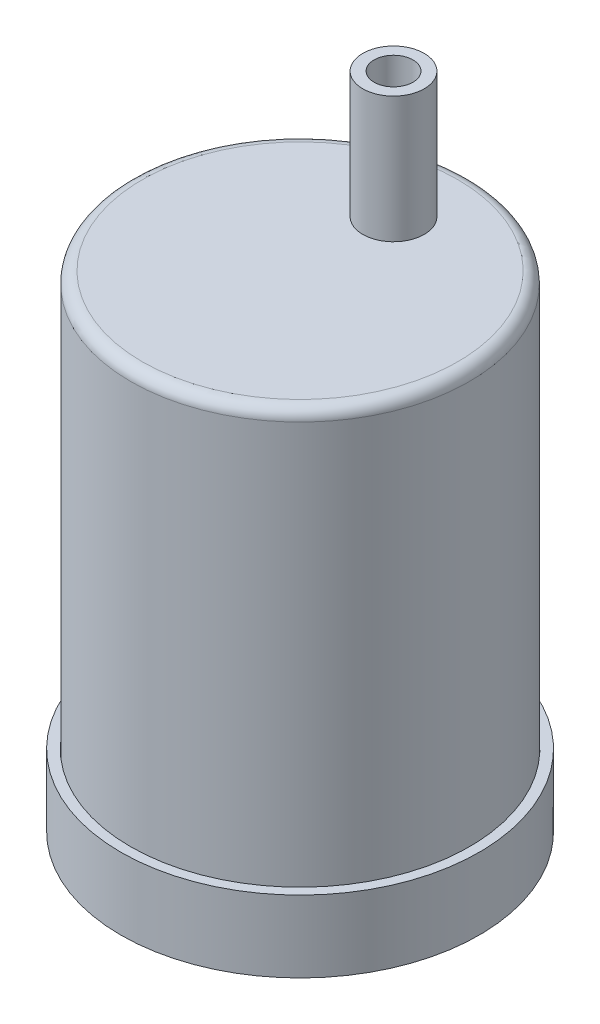
ISO-10303-21;
HEADER;
FILE_DESCRIPTION(('STEP AP214'),'2;1');
FILE_NAME('part.step','',(''),(''),'','','');
FILE_SCHEMA(('AUTOMOTIVE_DESIGN { 1 0 10303 214 1 1 1 1 }'));
ENDSEC;
DATA;
#1=APPLICATION_CONTEXT('core data for automotive mechanical design processes');
#2=APPLICATION_PROTOCOL_DEFINITION('international standard','automotive_design',2000,#1);
#3=PRODUCT_CONTEXT('',#1,'mechanical');
#4=PRODUCT('Part','Part','',(#3));
#5=PRODUCT_RELATED_PRODUCT_CATEGORY('part','',(#4));
#6=PRODUCT_DEFINITION_FORMATION('','',#4);
#7=PRODUCT_DEFINITION_CONTEXT('part definition',#1,'design');
#8=PRODUCT_DEFINITION('design','',#6,#7);
#9=PRODUCT_DEFINITION_SHAPE('','',#8);
#10=(LENGTH_UNIT() NAMED_UNIT(*) SI_UNIT(.MILLI.,.METRE.));
#11=(NAMED_UNIT(*) PLANE_ANGLE_UNIT() SI_UNIT($,.RADIAN.));
#12=(NAMED_UNIT(*) SI_UNIT($,.STERADIAN.) SOLID_ANGLE_UNIT());
#13=UNCERTAINTY_MEASURE_WITH_UNIT(LENGTH_MEASURE(1.E-05),#10,'distance_accuracy_value','');
#14=(GEOMETRIC_REPRESENTATION_CONTEXT(3) GLOBAL_UNCERTAINTY_ASSIGNED_CONTEXT((#13)) GLOBAL_UNIT_ASSIGNED_CONTEXT((#10,
#11,#12)) REPRESENTATION_CONTEXT('',''));
#15=CARTESIAN_POINT('',(0.,0.,0.));
#16=DIRECTION('',(0.,0.,1.));
#17=DIRECTION('',(1.,0.,0.));
#18=AXIS2_PLACEMENT_3D('',#15,#16,#17);
#19=CARTESIAN_POINT('',(0.,53.8,0.));
#20=DIRECTION('',(0.,1.,0.));
#21=DIRECTION('',(0.,0.,1.));
#22=AXIS2_PLACEMENT_3D('',#19,#20,#21);
#23=PLANE('',#22);
#24=CARTESIAN_POINT('',(0.,53.8,0.));
#25=DIRECTION('',(0.,1.,0.));
#26=DIRECTION('',(0.,0.,1.));
#27=AXIS2_PLACEMENT_3D('',#24,#25,#26);
#28=CIRCLE('',#27,17.4719);
#29=CARTESIAN_POINT('',(0.,53.8,17.4719));
#30=VERTEX_POINT('',#29);
#31=EDGE_CURVE('E88',#30,#30,#28,.T.);
#32=ORIENTED_EDGE('',*,*,#31,.T.);
#33=EDGE_LOOP('',(#32));
#34=FACE_BOUND('',#33,.T.);
#35=CARTESIAN_POINT('',(0.,53.8,-10.35));
#36=DIRECTION('',(0.,1.,0.));
#37=DIRECTION('',(0.,0.,1.));
#38=AXIS2_PLACEMENT_3D('',#35,#36,#37);
#39=CIRCLE('',#38,3.4);
#40=CARTESIAN_POINT('',(0.,53.8,-6.95));
#41=VERTEX_POINT('',#40);
#42=EDGE_CURVE('E108',#41,#41,#39,.T.);
#43=ORIENTED_EDGE('',*,*,#42,.F.);
#44=EDGE_LOOP('',(#43));
#45=FACE_BOUND('',#44,.T.);
#46=ADVANCED_FACE('F81',(#34,#45),#23,.T.);
#47=CARTESIAN_POINT('',(0.,1.5,0.));
#48=DIRECTION('',(0.,1.,0.));
#49=DIRECTION('',(0.,0.,1.));
#50=AXIS2_PLACEMENT_3D('',#47,#48,#49);
#51=PLANE('',#50);
#52=CARTESIAN_POINT('',(0.,1.5,0.));
#53=DIRECTION('',(0.,1.,0.));
#54=DIRECTION('',(0.,0.,1.));
#55=AXIS2_PLACEMENT_3D('',#52,#53,#54);
#56=CIRCLE('',#55,18.7419);
#57=CARTESIAN_POINT('',(0.,1.5,18.7419));
#58=VERTEX_POINT('',#57);
#59=EDGE_CURVE('E101',#58,#58,#56,.T.);
#60=ORIENTED_EDGE('',*,*,#59,.F.);
#61=EDGE_LOOP('',(#60));
#62=FACE_BOUND('',#61,.T.);
#63=CARTESIAN_POINT('',(0.,1.5,0.));
#64=DIRECTION('',(0.,1.,0.));
#65=DIRECTION('',(0.,0.,1.));
#66=AXIS2_PLACEMENT_3D('',#63,#64,#65);
#67=CIRCLE('',#66,17.5419);
#68=CARTESIAN_POINT('',(0.,1.5,17.5419));
#69=VERTEX_POINT('',#68);
#70=EDGE_CURVE('E104',#69,#69,#67,.T.);
#71=ORIENTED_EDGE('',*,*,#70,.T.);
#72=EDGE_LOOP('',(#71));
#73=FACE_BOUND('',#72,.T.);
#74=ADVANCED_FACE('F138',(#62,#73),#51,.F.);
#75=CARTESIAN_POINT('',(0.,52.3,0.));
#76=DIRECTION('',(0.,-1.,0.));
#77=DIRECTION('',(0.,0.,-1.));
#78=AXIS2_PLACEMENT_3D('',#75,#76,#77);
#79=CYLINDRICAL_SURFACE('',#78,18.7419);
#80=CARTESIAN_POINT('',(0.,52.53,0.));
#81=DIRECTION('',(0.,1.,0.));
#82=DIRECTION('',(0.,0.,1.));
#83=AXIS2_PLACEMENT_3D('',#80,#81,#82);
#84=CIRCLE('',#83,18.7419);
#85=CARTESIAN_POINT('',(0.,52.53,18.7419));
#86=VERTEX_POINT('',#85);
#87=EDGE_CURVE('E12',#86,#86,#84,.F.);
#88=ORIENTED_EDGE('',*,*,#87,.T.);
#89=EDGE_LOOP('',(#88));
#90=FACE_BOUND('',#89,.T.);
#91=ORIENTED_EDGE('',*,*,#59,.T.);
#92=EDGE_LOOP('',(#91));
#93=FACE_BOUND('',#92,.T.);
#94=ADVANCED_FACE('F143',(#90,#93),#79,.T.);
#95=CARTESIAN_POINT('',(0.,52.3,0.));
#96=DIRECTION('',(0.,-1.,0.));
#97=DIRECTION('',(0.,0.,-1.));
#98=AXIS2_PLACEMENT_3D('',#95,#96,#97);
#99=CYLINDRICAL_SURFACE('',#98,17.5419);
#100=CARTESIAN_POINT('',(0.,51.03,0.));
#101=DIRECTION('',(0.,1.,0.));
#102=DIRECTION('',(0.,0.,1.));
#103=AXIS2_PLACEMENT_3D('',#100,#101,#102);
#104=CIRCLE('',#103,17.5419);
#105=CARTESIAN_POINT('',(0.,51.03,17.5419));
#106=VERTEX_POINT('',#105);
#107=EDGE_CURVE('E96',#106,#106,#104,.T.);
#108=ORIENTED_EDGE('',*,*,#107,.T.);
#109=EDGE_LOOP('',(#108));
#110=FACE_BOUND('',#109,.T.);
#111=ORIENTED_EDGE('',*,*,#70,.F.);
#112=EDGE_LOOP('',(#111));
#113=FACE_BOUND('',#112,.T.);
#114=ADVANCED_FACE('F150',(#110,#113),#99,.F.);
#115=CARTESIAN_POINT('',(0.,52.3,0.));
#116=DIRECTION('',(0.,1.,0.));
#117=DIRECTION('',(0.,0.,1.));
#118=AXIS2_PLACEMENT_3D('',#115,#116,#117);
#119=PLANE('',#118);
#120=CARTESIAN_POINT('',(0.,52.3,0.));
#121=DIRECTION('',(0.,1.,0.));
#122=DIRECTION('',(0.,0.,1.));
#123=AXIS2_PLACEMENT_3D('',#120,#121,#122);
#124=CIRCLE('',#123,16.2719);
#125=CARTESIAN_POINT('',(0.,52.3,16.2719));
#126=VERTEX_POINT('',#125);
#127=EDGE_CURVE('E92',#126,#126,#124,.F.);
#128=ORIENTED_EDGE('',*,*,#127,.T.);
#129=EDGE_LOOP('',(#128));
#130=FACE_BOUND('',#129,.T.);
#131=CARTESIAN_POINT('',(0.,52.3,-10.35));
#132=DIRECTION('',(0.,1.,0.));
#133=DIRECTION('',(0.,0.,1.));
#134=AXIS2_PLACEMENT_3D('',#131,#132,#133);
#135=CIRCLE('',#134,2.15);
#136=CARTESIAN_POINT('',(0.,52.3,-8.2));
#137=VERTEX_POINT('',#136);
#138=EDGE_CURVE('E116',#137,#137,#135,.T.);
#139=ORIENTED_EDGE('',*,*,#138,.T.);
#140=EDGE_LOOP('',(#139));
#141=FACE_BOUND('',#140,.T.);
#142=ADVANCED_FACE('F120',(#130,#141),#119,.F.);
#143=CARTESIAN_POINT('',(0.,67.77,-10.35));
#144=DIRECTION('',(0.,1.,0.));
#145=DIRECTION('',(0.,0.,1.));
#146=AXIS2_PLACEMENT_3D('',#143,#144,#145);
#147=PLANE('',#146);
#148=CARTESIAN_POINT('',(0.,67.77,-10.35));
#149=DIRECTION('',(0.,1.,0.));
#150=DIRECTION('',(0.,0.,1.));
#151=AXIS2_PLACEMENT_3D('',#148,#149,#150);
#152=CIRCLE('',#151,3.4);
#153=CARTESIAN_POINT('',(0.,67.77,-6.95));
#154=VERTEX_POINT('',#153);
#155=EDGE_CURVE('E107',#154,#154,#152,.T.);
#156=ORIENTED_EDGE('',*,*,#155,.T.);
#157=EDGE_LOOP('',(#156));
#158=FACE_BOUND('',#157,.T.);
#159=CARTESIAN_POINT('',(0.,67.77,-10.35));
#160=DIRECTION('',(0.,1.,0.));
#161=DIRECTION('',(0.,0.,1.));
#162=AXIS2_PLACEMENT_3D('',#159,#160,#161);
#163=CIRCLE('',#162,2.15);
#164=CARTESIAN_POINT('',(0.,67.77,-8.2));
#165=VERTEX_POINT('',#164);
#166=EDGE_CURVE('E111',#165,#165,#163,.T.);
#167=ORIENTED_EDGE('',*,*,#166,.F.);
#168=EDGE_LOOP('',(#167));
#169=FACE_BOUND('',#168,.T.);
#170=ADVANCED_FACE('F133',(#158,#169),#147,.T.);
#171=CARTESIAN_POINT('',(0.,67.77,-10.35));
#172=DIRECTION('',(0.,-1.,0.));
#173=DIRECTION('',(0.,0.,-1.));
#174=AXIS2_PLACEMENT_3D('',#171,#172,#173);
#175=CYLINDRICAL_SURFACE('',#174,3.4);
#176=ORIENTED_EDGE('',*,*,#155,.F.);
#177=EDGE_LOOP('',(#176));
#178=FACE_BOUND('',#177,.T.);
#179=ORIENTED_EDGE('',*,*,#42,.T.);
#180=EDGE_LOOP('',(#179));
#181=FACE_BOUND('',#180,.T.);
#182=ADVANCED_FACE('F125',(#178,#181),#175,.T.);
#183=CARTESIAN_POINT('',(0.,67.77,-10.35));
#184=DIRECTION('',(0.,-1.,0.));
#185=DIRECTION('',(0.,0.,-1.));
#186=AXIS2_PLACEMENT_3D('',#183,#184,#185);
#187=CYLINDRICAL_SURFACE('',#186,2.15);
#188=ORIENTED_EDGE('',*,*,#166,.T.);
#189=EDGE_LOOP('',(#188));
#190=FACE_BOUND('',#189,.T.);
#191=ORIENTED_EDGE('',*,*,#138,.F.);
#192=EDGE_LOOP('',(#191));
#193=FACE_BOUND('',#192,.T.);
#194=ADVANCED_FACE('F122',(#190,#193),#187,.F.);
#195=CARTESIAN_POINT('',(0.,51.03,0.));
#196=DIRECTION('',(0.,1.,0.));
#197=DIRECTION('',(0.,0.,1.));
#198=AXIS2_PLACEMENT_3D('',#195,#196,#197);
#199=TOROIDAL_SURFACE('',#198,16.2719,1.27);
#200=ORIENTED_EDGE('',*,*,#127,.F.);
#201=EDGE_LOOP('',(#200));
#202=FACE_BOUND('',#201,.T.);
#203=ORIENTED_EDGE('',*,*,#107,.F.);
#204=EDGE_LOOP('',(#203));
#205=FACE_BOUND('',#204,.T.);
#206=ADVANCED_FACE('F124',(#202,#205),#199,.F.);
#207=CARTESIAN_POINT('',(0.,52.53,0.));
#208=DIRECTION('',(0.,1.,0.));
#209=DIRECTION('',(0.,0.,1.));
#210=AXIS2_PLACEMENT_3D('',#207,#208,#209);
#211=TOROIDAL_SURFACE('',#210,17.4719,1.27);
#212=ORIENTED_EDGE('',*,*,#87,.F.);
#213=EDGE_LOOP('',(#212));
#214=FACE_BOUND('',#213,.T.);
#215=ORIENTED_EDGE('',*,*,#31,.F.);
#216=EDGE_LOOP('',(#215));
#217=FACE_BOUND('',#216,.T.);
#218=ADVANCED_FACE('F83',(#214,#217),#211,.T.);
#219=CLOSED_SHELL('',(#46,#74,#94,#114,#142,#170,#182,#194,#206,#218));
#220=MANIFOLD_SOLID_BREP('B2',#219);
#221=CARTESIAN_POINT('',(-3.4,-8.659999892,-10.35));
#222=DIRECTION('',(1.,0.,0.));
#223=DIRECTION('',(0.,0.,-1.));
#224=AXIS2_PLACEMENT_3D('',#221,#222,#223);
#225=PLANE('',#224);
#226=DIRECTION('',(0.,0.,-1.));
#227=VECTOR('',#226,1.);
#228=CARTESIAN_POINT('',(-3.4,0.,-10.35));
#229=LINE('',#228,#227);
#230=CARTESIAN_POINT('',(-3.4,0.,-10.35));
#231=VERTEX_POINT('',#230);
#232=CARTESIAN_POINT('',(-3.4,0.,-11.0877761570414));
#233=VERTEX_POINT('',#232);
#234=EDGE_CURVE('E324',#231,#233,#229,.T.);
#235=ORIENTED_EDGE('',*,*,#234,.F.);
#236=DIRECTION('',(0.,1.,0.));
#237=VECTOR('',#236,1.);
#238=CARTESIAN_POINT('',(-3.4,-8.659999892,-10.35));
#239=LINE('',#238,#237);
#240=CARTESIAN_POINT('',(-3.4,14.809999892,-10.35));
#241=VERTEX_POINT('',#240);
#242=EDGE_CURVE('E333',#231,#241,#239,.T.);
#243=ORIENTED_EDGE('',*,*,#242,.T.);
#244=DIRECTION('',(0.,0.,-1.));
#245=VECTOR('',#244,1.);
#246=CARTESIAN_POINT('',(-3.4,14.809999892,-10.35));
#247=LINE('',#246,#245);
#248=CARTESIAN_POINT('',(-3.4,14.809999892,-11.0877761570414));
#249=VERTEX_POINT('',#248);
#250=EDGE_CURVE('E408',#241,#249,#247,.T.);
#251=ORIENTED_EDGE('',*,*,#250,.T.);
#252=DIRECTION('',(0.,-1.,0.));
#253=VECTOR('',#252,1.);
#254=CARTESIAN_POINT('',(-3.4,14.809999892,-11.0877761570414));
#255=LINE('',#254,#253);
#256=EDGE_CURVE('E335',#249,#233,#255,.T.);
#257=ORIENTED_EDGE('',*,*,#256,.T.);
#258=EDGE_LOOP('',(#235,#243,#251,#257));
#259=FACE_BOUND('',#258,.T.);
#260=ADVANCED_FACE('F239',(#259),#225,.F.);
#261=CARTESIAN_POINT('',(3.4,-8.659999892,-10.35));
#262=DIRECTION('',(1.,0.,0.));
#263=DIRECTION('',(0.,0.,-1.));
#264=AXIS2_PLACEMENT_3D('',#261,#262,#263);
#265=PLANE('',#264);
#266=DIRECTION('',(0.,1.,0.));
#267=VECTOR('',#266,1.);
#268=CARTESIAN_POINT('',(3.4,-8.659999892,-10.35));
#269=LINE('',#268,#267);
#270=CARTESIAN_POINT('',(3.4,0.,-10.35));
#271=VERTEX_POINT('',#270);
#272=CARTESIAN_POINT('',(3.4,14.809999892,-10.35));
#273=VERTEX_POINT('',#272);
#274=EDGE_CURVE('E344',#271,#273,#269,.T.);
#275=ORIENTED_EDGE('',*,*,#274,.F.);
#276=DIRECTION('',(0.,0.,-1.));
#277=VECTOR('',#276,1.);
#278=CARTESIAN_POINT('',(3.4,0.,-10.35));
#279=LINE('',#278,#277);
#280=CARTESIAN_POINT('',(3.4,0.,-11.0877761570414));
#281=VERTEX_POINT('',#280);
#282=EDGE_CURVE('E326',#271,#281,#279,.T.);
#283=ORIENTED_EDGE('',*,*,#282,.T.);
#284=DIRECTION('',(0.,-1.,0.));
#285=VECTOR('',#284,1.);
#286=CARTESIAN_POINT('',(3.4,14.809999892,-11.0877761570414));
#287=LINE('',#286,#285);
#288=CARTESIAN_POINT('',(3.4,14.809999892,-11.0877761570414));
#289=VERTEX_POINT('',#288);
#290=EDGE_CURVE('E361',#289,#281,#287,.T.);
#291=ORIENTED_EDGE('',*,*,#290,.F.);
#292=DIRECTION('',(0.,0.,-1.));
#293=VECTOR('',#292,1.);
#294=CARTESIAN_POINT('',(3.4,14.809999892,-10.35));
#295=LINE('',#294,#293);
#296=EDGE_CURVE('E405',#273,#289,#295,.T.);
#297=ORIENTED_EDGE('',*,*,#296,.F.);
#298=EDGE_LOOP('',(#275,#283,#291,#297));
#299=FACE_BOUND('',#298,.T.);
#300=ADVANCED_FACE('F445',(#299),#265,.T.);
#301=CARTESIAN_POINT('',(-2.15,-8.659999892,-10.35));
#302=DIRECTION('',(1.,0.,0.));
#303=DIRECTION('',(0.,0.,-1.));
#304=AXIS2_PLACEMENT_3D('',#301,#302,#303);
#305=PLANE('',#304);
#306=DIRECTION('',(0.,1.,0.));
#307=VECTOR('',#306,1.);
#308=CARTESIAN_POINT('',(-2.15,-8.659999892,-10.35));
#309=LINE('',#308,#307);
#310=CARTESIAN_POINT('',(-2.15,0.,-10.35));
#311=VERTEX_POINT('',#310);
#312=CARTESIAN_POINT('',(-2.15,16.31,-10.35));
#313=VERTEX_POINT('',#312);
#314=EDGE_CURVE('E394',#311,#313,#309,.T.);
#315=ORIENTED_EDGE('',*,*,#314,.F.);
#316=DIRECTION('',(0.,0.,1.));
#317=VECTOR('',#316,1.);
#318=CARTESIAN_POINT('',(-2.15,0.,-10.35));
#319=LINE('',#318,#317);
#320=CARTESIAN_POINT('',(-2.15,0.,-12.5));
#321=VERTEX_POINT('',#320);
#322=EDGE_CURVE('E417',#321,#311,#319,.T.);
#323=ORIENTED_EDGE('',*,*,#322,.F.);
#324=DIRECTION('',(0.,1.,0.));
#325=VECTOR('',#324,1.);
#326=CARTESIAN_POINT('',(-2.15,-8.659999892,-12.5));
#327=LINE('',#326,#325);
#328=CARTESIAN_POINT('',(-2.15,1.5,-12.5));
#329=VERTEX_POINT('',#328);
#330=EDGE_CURVE('E397',#321,#329,#327,.T.);
#331=ORIENTED_EDGE('',*,*,#330,.T.);
#332=DIRECTION('',(0.,0.,1.));
#333=VECTOR('',#332,1.);
#334=CARTESIAN_POINT('',(-2.15,1.5,-10.35));
#335=LINE('',#334,#333);
#336=CARTESIAN_POINT('',(-2.15,1.5,-12.3137118692943));
#337=VERTEX_POINT('',#336);
#338=EDGE_CURVE('E385',#329,#337,#335,.T.);
#339=ORIENTED_EDGE('',*,*,#338,.T.);
#340=DIRECTION('',(0.,1.,0.));
#341=VECTOR('',#340,1.);
#342=CARTESIAN_POINT('',(-2.15,1.5,-12.3137118692943));
#343=LINE('',#342,#341);
#344=CARTESIAN_POINT('',(-2.15,16.31,-12.3137118692943));
#345=VERTEX_POINT('',#344);
#346=EDGE_CURVE('E414',#337,#345,#343,.T.);
#347=ORIENTED_EDGE('',*,*,#346,.T.);
#348=DIRECTION('',(0.,0.,-1.));
#349=VECTOR('',#348,1.);
#350=CARTESIAN_POINT('',(-2.15,16.31,-10.35));
#351=LINE('',#350,#349);
#352=EDGE_CURVE('E384',#313,#345,#351,.T.);
#353=ORIENTED_EDGE('',*,*,#352,.F.);
#354=EDGE_LOOP('',(#315,#323,#331,#339,#347,#353));
#355=FACE_BOUND('',#354,.T.);
#356=ADVANCED_FACE('F420',(#355),#305,.T.);
#357=CARTESIAN_POINT('',(2.15,-8.659999892,-10.35));
#358=DIRECTION('',(1.,0.,0.));
#359=DIRECTION('',(0.,0.,-1.));
#360=AXIS2_PLACEMENT_3D('',#357,#358,#359);
#361=PLANE('',#360);
#362=DIRECTION('',(0.,0.,1.));
#363=VECTOR('',#362,1.);
#364=CARTESIAN_POINT('',(2.15,0.,-10.35));
#365=LINE('',#364,#363);
#366=CARTESIAN_POINT('',(2.15,0.,-12.5));
#367=VERTEX_POINT('',#366);
#368=CARTESIAN_POINT('',(2.15,0.,-10.35));
#369=VERTEX_POINT('',#368);
#370=EDGE_CURVE('E655',#367,#369,#365,.T.);
#371=ORIENTED_EDGE('',*,*,#370,.T.);
#372=DIRECTION('',(0.,1.,0.));
#373=VECTOR('',#372,1.);
#374=CARTESIAN_POINT('',(2.15,-8.659999892,-10.35));
#375=LINE('',#374,#373);
#376=CARTESIAN_POINT('',(2.15,16.31,-10.35));
#377=VERTEX_POINT('',#376);
#378=EDGE_CURVE('E380',#369,#377,#375,.T.);
#379=ORIENTED_EDGE('',*,*,#378,.T.);
#380=DIRECTION('',(0.,0.,-1.));
#381=VECTOR('',#380,1.);
#382=CARTESIAN_POINT('',(2.15,16.31,-10.35));
#383=LINE('',#382,#381);
#384=CARTESIAN_POINT('',(2.15,16.31,-12.3137118692943));
#385=VERTEX_POINT('',#384);
#386=EDGE_CURVE('E378',#377,#385,#383,.T.);
#387=ORIENTED_EDGE('',*,*,#386,.T.);
#388=DIRECTION('',(0.,1.,0.));
#389=VECTOR('',#388,1.);
#390=CARTESIAN_POINT('',(2.15,1.5,-12.3137118692943));
#391=LINE('',#390,#389);
#392=CARTESIAN_POINT('',(2.15,1.5,-12.3137118692943));
#393=VERTEX_POINT('',#392);
#394=EDGE_CURVE('E247',#393,#385,#391,.T.);
#395=ORIENTED_EDGE('',*,*,#394,.F.);
#396=DIRECTION('',(0.,0.,1.));
#397=VECTOR('',#396,1.);
#398=CARTESIAN_POINT('',(2.15,1.5,-10.35));
#399=LINE('',#398,#397);
#400=CARTESIAN_POINT('',(2.15,1.5,-12.5));
#401=VERTEX_POINT('',#400);
#402=EDGE_CURVE('E79',#401,#393,#399,.T.);
#403=ORIENTED_EDGE('',*,*,#402,.F.);
#404=DIRECTION('',(0.,1.,0.));
#405=VECTOR('',#404,1.);
#406=CARTESIAN_POINT('',(2.15,-8.659999892,-12.5));
#407=LINE('',#406,#405);
#408=EDGE_CURVE('E388',#367,#401,#407,.T.);
#409=ORIENTED_EDGE('',*,*,#408,.F.);
#410=EDGE_LOOP('',(#371,#379,#387,#395,#403,#409));
#411=FACE_BOUND('',#410,.T.);
#412=ADVANCED_FACE('F379',(#411),#361,.F.);
#413=CARTESIAN_POINT('',(0.,0.,0.));
#414=DIRECTION('',(0.,1.,0.));
#415=DIRECTION('',(0.,0.,1.));
#416=AXIS2_PLACEMENT_3D('',#413,#414,#415);
#417=PLANE('',#416);
#418=ORIENTED_EDGE('',*,*,#234,.T.);
#419=CARTESIAN_POINT('',(0.,0.,0.));
#420=DIRECTION('',(0.,-1.,0.));
#421=DIRECTION('',(0.,0.,-1.));
#422=AXIS2_PLACEMENT_3D('',#419,#420,#421);
#423=CIRCLE('',#422,11.5973609113736);
#424=EDGE_CURVE('E343',#281,#233,#423,.T.);
#425=ORIENTED_EDGE('',*,*,#424,.F.);
#426=ORIENTED_EDGE('',*,*,#282,.F.);
#427=CARTESIAN_POINT('',(0.,0.,-10.35));
#428=DIRECTION('',(0.,-1.,0.));
#429=DIRECTION('',(0.,0.,-1.));
#430=AXIS2_PLACEMENT_3D('',#427,#428,#429);
#431=CIRCLE('',#430,3.4);
#432=EDGE_CURVE('E254',#231,#271,#431,.T.);
#433=ORIENTED_EDGE('',*,*,#432,.F.);
#434=EDGE_LOOP('',(#418,#425,#426,#433));
#435=FACE_BOUND('',#434,.T.);
#436=CARTESIAN_POINT('',(0.,0.,0.));
#437=DIRECTION('',(0.,1.,0.));
#438=DIRECTION('',(0.,0.,1.));
#439=AXIS2_PLACEMENT_3D('',#436,#437,#438);
#440=CIRCLE('',#439,19.85);
#441=CARTESIAN_POINT('',(0.,0.,19.85));
#442=VERTEX_POINT('',#441);
#443=EDGE_CURVE('E357',#442,#442,#440,.T.);
#444=ORIENTED_EDGE('',*,*,#443,.F.);
#445=EDGE_LOOP('',(#444));
#446=FACE_BOUND('',#445,.T.);
#447=ADVANCED_FACE('F321',(#435,#446),#417,.F.);
#448=CARTESIAN_POINT('',(-3.4,16.31,-10.35));
#449=DIRECTION('',(0.,-1.,0.));
#450=DIRECTION('',(0.,0.,-1.));
#451=AXIS2_PLACEMENT_3D('',#448,#449,#450);
#452=PLANE('',#451);
#453=CARTESIAN_POINT('',(0.,16.31,0.));
#454=DIRECTION('',(0.,-1.,0.));
#455=DIRECTION('',(0.,0.,-1.));
#456=AXIS2_PLACEMENT_3D('',#453,#454,#455);
#457=CIRCLE('',#456,12.5);
#458=EDGE_CURVE('E373',#385,#345,#457,.T.);
#459=ORIENTED_EDGE('',*,*,#458,.F.);
#460=ORIENTED_EDGE('',*,*,#386,.F.);
#461=CARTESIAN_POINT('',(0.,16.31,-10.35));
#462=DIRECTION('',(0.,1.,0.));
#463=DIRECTION('',(0.,0.,1.));
#464=AXIS2_PLACEMENT_3D('',#461,#462,#463);
#465=CIRCLE('',#464,2.15);
#466=EDGE_CURVE('E399',#313,#377,#465,.T.);
#467=ORIENTED_EDGE('',*,*,#466,.F.);
#468=ORIENTED_EDGE('',*,*,#352,.T.);
#469=EDGE_LOOP('',(#459,#460,#467,#468));
#470=FACE_BOUND('',#469,.T.);
#471=ADVANCED_FACE('F434',(#470),#452,.F.);
#472=CARTESIAN_POINT('',(2.15,-8.659999892,-12.5));
#473=DIRECTION('',(0.,0.,-1.));
#474=DIRECTION('',(-1.,0.,0.));
#475=AXIS2_PLACEMENT_3D('',#472,#473,#474);
#476=PLANE('',#475);
#477=ORIENTED_EDGE('',*,*,#330,.F.);
#478=DIRECTION('',(1.,0.,0.));
#479=VECTOR('',#478,1.);
#480=CARTESIAN_POINT('',(2.15,0.,-12.5));
#481=LINE('',#480,#479);
#482=CARTESIAN_POINT('',(0.,0.,-12.5));
#483=VERTEX_POINT('',#482);
#484=EDGE_CURVE('E427',#321,#483,#481,.T.);
#485=ORIENTED_EDGE('',*,*,#484,.T.);
#486=DIRECTION('',(-1.,0.,0.));
#487=VECTOR('',#486,1.);
#488=CARTESIAN_POINT('',(2.15,0.,-12.5));
#489=LINE('',#488,#487);
#490=EDGE_CURVE('E651',#367,#483,#489,.T.);
#491=ORIENTED_EDGE('',*,*,#490,.F.);
#492=ORIENTED_EDGE('',*,*,#408,.T.);
#493=DIRECTION('',(1.,0.,0.));
#494=VECTOR('',#493,1.);
#495=CARTESIAN_POINT('',(2.15,1.5,-12.5));
#496=LINE('',#495,#494);
#497=EDGE_CURVE('E391',#329,#401,#496,.T.);
#498=ORIENTED_EDGE('',*,*,#497,.F.);
#499=EDGE_LOOP('',(#477,#485,#491,#492,#498));
#500=FACE_BOUND('',#499,.T.);
#501=ADVANCED_FACE('F425',(#500),#476,.F.);
#502=CARTESIAN_POINT('',(0.,1.5,0.));
#503=DIRECTION('',(0.,-1.,0.));
#504=DIRECTION('',(0.,0.,-1.));
#505=AXIS2_PLACEMENT_3D('',#502,#503,#504);
#506=PLANE('',#505);
#507=CARTESIAN_POINT('',(0.,1.5,0.));
#508=DIRECTION('',(0.,-1.,0.));
#509=DIRECTION('',(0.,0.,-1.));
#510=AXIS2_PLACEMENT_3D('',#507,#508,#509);
#511=CIRCLE('',#510,18.78);
#512=CARTESIAN_POINT('',(0.,1.5,-18.78));
#513=VERTEX_POINT('',#512);
#514=EDGE_CURVE('E346',#513,#513,#511,.T.);
#515=ORIENTED_EDGE('',*,*,#514,.F.);
#516=EDGE_LOOP('',(#515));
#517=FACE_BOUND('',#516,.T.);
#518=CARTESIAN_POINT('',(0.,1.5,0.));
#519=DIRECTION('',(0.,-1.,0.));
#520=DIRECTION('',(0.,0.,-1.));
#521=AXIS2_PLACEMENT_3D('',#518,#519,#520);
#522=CIRCLE('',#521,12.5);
#523=EDGE_CURVE('E348',#393,#337,#522,.T.);
#524=ORIENTED_EDGE('',*,*,#523,.T.);
#525=ORIENTED_EDGE('',*,*,#338,.F.);
#526=ORIENTED_EDGE('',*,*,#497,.T.);
#527=ORIENTED_EDGE('',*,*,#402,.T.);
#528=EDGE_LOOP('',(#524,#525,#526,#527));
#529=FACE_BOUND('',#528,.T.);
#530=ADVANCED_FACE('F411',(#517,#529),#506,.F.);
#531=CARTESIAN_POINT('',(0.,14.809999892,0.));
#532=DIRECTION('',(0.,-1.,0.));
#533=DIRECTION('',(0.,0.,-1.));
#534=AXIS2_PLACEMENT_3D('',#531,#532,#533);
#535=CYLINDRICAL_SURFACE('',#534,11.5973609113736);
#536=ORIENTED_EDGE('',*,*,#256,.F.);
#537=CARTESIAN_POINT('',(0.,14.809999892,0.));
#538=DIRECTION('',(0.,-1.,0.));
#539=DIRECTION('',(0.,0.,-1.));
#540=AXIS2_PLACEMENT_3D('',#537,#538,#539);
#541=CIRCLE('',#540,11.5973609113736);
#542=EDGE_CURVE('E401',#289,#249,#541,.T.);
#543=ORIENTED_EDGE('',*,*,#542,.F.);
#544=ORIENTED_EDGE('',*,*,#290,.T.);
#545=ORIENTED_EDGE('',*,*,#424,.T.);
#546=EDGE_LOOP('',(#536,#543,#544,#545));
#547=FACE_BOUND('',#546,.T.);
#548=ADVANCED_FACE('F455',(#547),#535,.F.);
#549=CARTESIAN_POINT('',(0.,7.95,0.));
#550=DIRECTION('',(0.,-1.,0.));
#551=DIRECTION('',(0.,0.,-1.));
#552=AXIS2_PLACEMENT_3D('',#549,#550,#551);
#553=CYLINDRICAL_SURFACE('',#552,18.78);
#554=CARTESIAN_POINT('',(0.,7.95,0.));
#555=DIRECTION('',(0.,1.,0.));
#556=DIRECTION('',(0.,0.,1.));
#557=AXIS2_PLACEMENT_3D('',#554,#555,#556);
#558=CIRCLE('',#557,18.78);
#559=CARTESIAN_POINT('',(0.,7.95,18.78));
#560=VERTEX_POINT('',#559);
#561=EDGE_CURVE('E354',#560,#560,#558,.T.);
#562=ORIENTED_EDGE('',*,*,#561,.T.);
#563=EDGE_LOOP('',(#562));
#564=FACE_BOUND('',#563,.T.);
#565=ORIENTED_EDGE('',*,*,#514,.T.);
#566=EDGE_LOOP('',(#565));
#567=FACE_BOUND('',#566,.T.);
#568=ADVANCED_FACE('F458',(#564,#567),#553,.F.);
#569=CARTESIAN_POINT('',(0.,7.95,0.));
#570=DIRECTION('',(0.,1.,0.));
#571=DIRECTION('',(0.,0.,1.));
#572=AXIS2_PLACEMENT_3D('',#569,#570,#571);
#573=PLANE('',#572);
#574=CARTESIAN_POINT('',(0.,7.95,0.));
#575=DIRECTION('',(0.,1.,0.));
#576=DIRECTION('',(0.,0.,1.));
#577=AXIS2_PLACEMENT_3D('',#574,#575,#576);
#578=CIRCLE('',#577,19.85);
#579=CARTESIAN_POINT('',(0.,7.95,19.85));
#580=VERTEX_POINT('',#579);
#581=EDGE_CURVE('E358',#580,#580,#578,.T.);
#582=ORIENTED_EDGE('',*,*,#581,.T.);
#583=EDGE_LOOP('',(#582));
#584=FACE_BOUND('',#583,.T.);
#585=ORIENTED_EDGE('',*,*,#561,.F.);
#586=EDGE_LOOP('',(#585));
#587=FACE_BOUND('',#586,.T.);
#588=ADVANCED_FACE('F465',(#584,#587),#573,.T.);
#589=CARTESIAN_POINT('',(0.,7.95,0.));
#590=DIRECTION('',(0.,-1.,0.));
#591=DIRECTION('',(0.,0.,-1.));
#592=AXIS2_PLACEMENT_3D('',#589,#590,#591);
#593=CYLINDRICAL_SURFACE('',#592,19.85);
#594=ORIENTED_EDGE('',*,*,#581,.F.);
#595=EDGE_LOOP('',(#594));
#596=FACE_BOUND('',#595,.T.);
#597=ORIENTED_EDGE('',*,*,#443,.T.);
#598=EDGE_LOOP('',(#597));
#599=FACE_BOUND('',#598,.T.);
#600=ADVANCED_FACE('F241',(#596,#599),#593,.T.);
#601=CARTESIAN_POINT('',(0.,-8.659999892,-10.35));
#602=DIRECTION('',(0.,1.,0.));
#603=DIRECTION('',(0.,0.,1.));
#604=AXIS2_PLACEMENT_3D('',#601,#602,#603);
#605=CYLINDRICAL_SURFACE('',#604,3.4);
#606=ORIENTED_EDGE('',*,*,#432,.T.);
#607=ORIENTED_EDGE('',*,*,#274,.T.);
#608=CARTESIAN_POINT('',(0.,14.809999892,-10.35));
#609=DIRECTION('',(0.,-1.,0.));
#610=DIRECTION('',(0.,0.,-1.));
#611=AXIS2_PLACEMENT_3D('',#608,#609,#610);
#612=CIRCLE('',#611,3.4);
#613=EDGE_CURVE('E341',#241,#273,#612,.F.);
#614=ORIENTED_EDGE('',*,*,#613,.F.);
#615=ORIENTED_EDGE('',*,*,#242,.F.);
#616=EDGE_LOOP('',(#606,#607,#614,#615));
#617=FACE_BOUND('',#616,.T.);
#618=CARTESIAN_POINT('',(0.,-14.,-10.35));
#619=DIRECTION('',(0.,-1.,0.));
#620=DIRECTION('',(0.,0.,-1.));
#621=AXIS2_PLACEMENT_3D('',#618,#619,#620);
#622=CIRCLE('',#621,3.4);
#623=CARTESIAN_POINT('',(0.,-14.,-13.75));
#624=VERTEX_POINT('',#623);
#625=EDGE_CURVE('E328',#624,#624,#622,.T.);
#626=ORIENTED_EDGE('',*,*,#625,.F.);
#627=EDGE_LOOP('',(#626));
#628=FACE_BOUND('',#627,.T.);
#629=ADVANCED_FACE('F338',(#617,#628),#605,.T.);
#630=CARTESIAN_POINT('',(0.,14.809999892,0.));
#631=DIRECTION('',(0.,-1.,0.));
#632=DIRECTION('',(0.,0.,-1.));
#633=AXIS2_PLACEMENT_3D('',#630,#631,#632);
#634=PLANE('',#633);
#635=ORIENTED_EDGE('',*,*,#250,.F.);
#636=ORIENTED_EDGE('',*,*,#613,.T.);
#637=ORIENTED_EDGE('',*,*,#296,.T.);
#638=ORIENTED_EDGE('',*,*,#542,.T.);
#639=EDGE_LOOP('',(#635,#636,#637,#638));
#640=FACE_BOUND('',#639,.T.);
#641=ADVANCED_FACE('F454',(#640),#634,.T.);
#642=CARTESIAN_POINT('',(0.,16.31,0.));
#643=DIRECTION('',(0.,-1.,0.));
#644=DIRECTION('',(0.,0.,-1.));
#645=AXIS2_PLACEMENT_3D('',#642,#643,#644);
#646=CYLINDRICAL_SURFACE('',#645,12.5);
#647=ORIENTED_EDGE('',*,*,#458,.T.);
#648=ORIENTED_EDGE('',*,*,#346,.F.);
#649=ORIENTED_EDGE('',*,*,#523,.F.);
#650=ORIENTED_EDGE('',*,*,#394,.T.);
#651=EDGE_LOOP('',(#647,#648,#649,#650));
#652=FACE_BOUND('',#651,.T.);
#653=ADVANCED_FACE('F371',(#652),#646,.T.);
#654=CARTESIAN_POINT('',(0.,-8.659999892,-10.35));
#655=DIRECTION('',(0.,1.,0.));
#656=DIRECTION('',(0.,0.,1.));
#657=AXIS2_PLACEMENT_3D('',#654,#655,#656);
#658=CYLINDRICAL_SURFACE('',#657,2.15);
#659=CARTESIAN_POINT('',(0.,0.,-10.35));
#660=DIRECTION('',(0.,-1.,0.));
#661=DIRECTION('',(0.,0.,-1.));
#662=AXIS2_PLACEMENT_3D('',#659,#660,#661);
#663=CIRCLE('',#662,2.15);
#664=EDGE_CURVE('E336',#311,#483,#663,.T.);
#665=ORIENTED_EDGE('',*,*,#664,.F.);
#666=ORIENTED_EDGE('',*,*,#314,.T.);
#667=ORIENTED_EDGE('',*,*,#466,.T.);
#668=ORIENTED_EDGE('',*,*,#378,.F.);
#669=EDGE_CURVE('E262',#483,#369,#663,.T.);
#670=ORIENTED_EDGE('',*,*,#669,.F.);
#671=EDGE_LOOP('',(#665,#666,#667,#668,#670));
#672=FACE_BOUND('',#671,.T.);
#673=CARTESIAN_POINT('',(0.,-14.,-10.35));
#674=DIRECTION('',(0.,-1.,0.));
#675=DIRECTION('',(0.,0.,-1.));
#676=AXIS2_PLACEMENT_3D('',#673,#674,#675);
#677=CIRCLE('',#676,2.15);
#678=CARTESIAN_POINT('',(0.,-14.,-12.5));
#679=VERTEX_POINT('',#678);
#680=EDGE_CURVE('E329',#679,#679,#677,.T.);
#681=ORIENTED_EDGE('',*,*,#680,.T.);
#682=EDGE_LOOP('',(#681));
#683=FACE_BOUND('',#682,.T.);
#684=ADVANCED_FACE('F432',(#672,#683),#658,.F.);
#685=CARTESIAN_POINT('',(0.,0.,-10.35));
#686=DIRECTION('',(0.,-1.,0.));
#687=DIRECTION('',(0.,0.,-1.));
#688=AXIS2_PLACEMENT_3D('',#685,#686,#687);
#689=PLANE('',#688);
#690=ORIENTED_EDGE('',*,*,#322,.T.);
#691=ORIENTED_EDGE('',*,*,#664,.T.);
#692=ORIENTED_EDGE('',*,*,#484,.F.);
#693=EDGE_LOOP('',(#690,#691,#692));
#694=FACE_BOUND('',#693,.T.);
#695=ADVANCED_FACE('F508',(#694),#689,.F.);
#696=ORIENTED_EDGE('',*,*,#669,.T.);
#697=ORIENTED_EDGE('',*,*,#370,.F.);
#698=ORIENTED_EDGE('',*,*,#490,.T.);
#699=EDGE_LOOP('',(#696,#697,#698));
#700=FACE_BOUND('',#699,.T.);
#701=ADVANCED_FACE('F516',(#700),#689,.F.);
#702=CARTESIAN_POINT('',(0.,-14.,-10.35));
#703=DIRECTION('',(0.,-1.,0.));
#704=DIRECTION('',(0.,0.,-1.));
#705=AXIS2_PLACEMENT_3D('',#702,#703,#704);
#706=PLANE('',#705);
#707=ORIENTED_EDGE('',*,*,#625,.T.);
#708=EDGE_LOOP('',(#707));
#709=FACE_BOUND('',#708,.T.);
#710=ORIENTED_EDGE('',*,*,#680,.F.);
#711=EDGE_LOOP('',(#710));
#712=FACE_BOUND('',#711,.T.);
#713=ADVANCED_FACE('F524',(#709,#712),#706,.T.);
#714=CLOSED_SHELL('',(#260,#300,#356,#412,#447,#471,#501,#530,#548,#568,#588,#600,#629,#641,
#653,#684,#695,#701,#713));
#715=MANIFOLD_SOLID_BREP('B7_NOT_SHOWN',#714);
#716=ADVANCED_BREP_SHAPE_REPRESENTATION('',(#18,#220,#715),#14);
#717=SHAPE_DEFINITION_REPRESENTATION(#9,#716);
ENDSEC;
END-ISO-10303-21;
